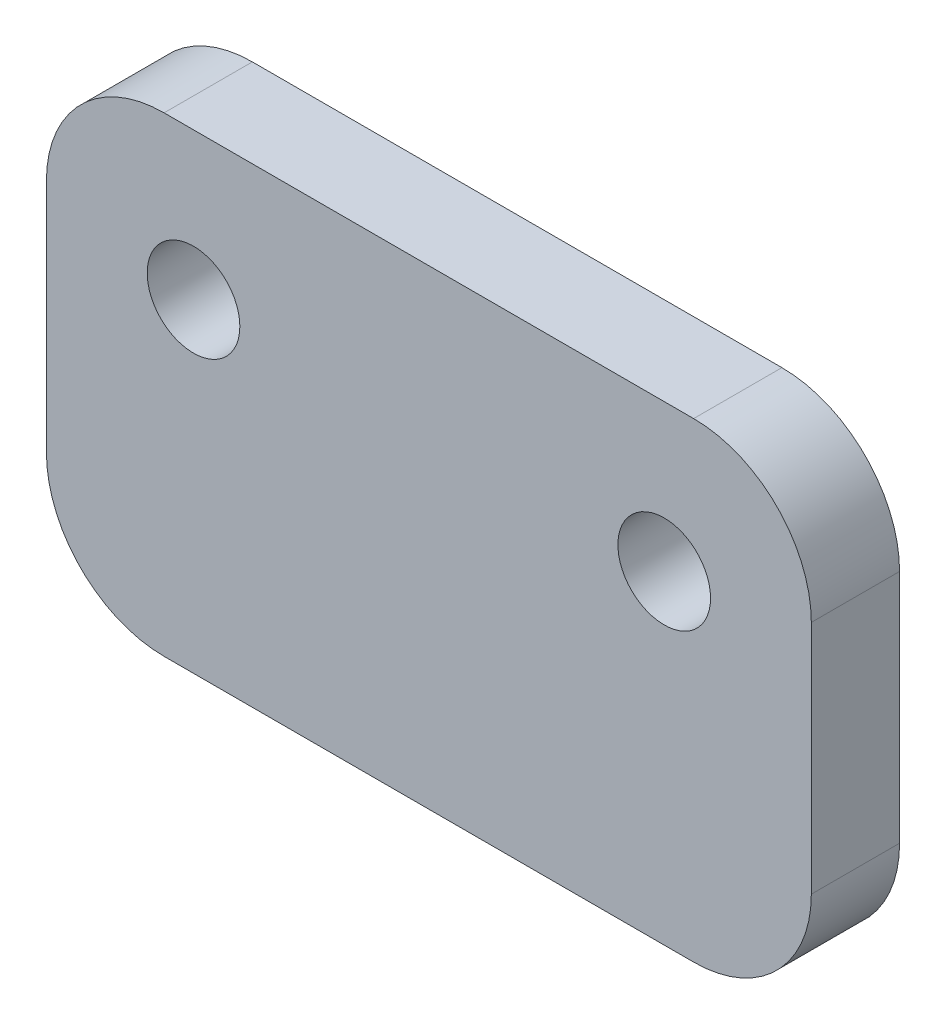
ISO-10303-21;
HEADER;
FILE_DESCRIPTION(('STEP AP214'),'2;1');
FILE_NAME('part.step','',(''),(''),'','','');
FILE_SCHEMA(('AUTOMOTIVE_DESIGN { 1 0 10303 214 1 1 1 1 }'));
ENDSEC;
DATA;
#1=APPLICATION_CONTEXT('core data for automotive mechanical design processes');
#2=APPLICATION_PROTOCOL_DEFINITION('international standard','automotive_design',2000,#1);
#3=PRODUCT_CONTEXT('',#1,'mechanical');
#4=PRODUCT('Part','Part','',(#3));
#5=PRODUCT_RELATED_PRODUCT_CATEGORY('part','',(#4));
#6=PRODUCT_DEFINITION_FORMATION('','',#4);
#7=PRODUCT_DEFINITION_CONTEXT('part definition',#1,'design');
#8=PRODUCT_DEFINITION('design','',#6,#7);
#9=PRODUCT_DEFINITION_SHAPE('','',#8);
#10=(LENGTH_UNIT() NAMED_UNIT(*) SI_UNIT(.MILLI.,.METRE.));
#11=(NAMED_UNIT(*) PLANE_ANGLE_UNIT() SI_UNIT($,.RADIAN.));
#12=(NAMED_UNIT(*) SI_UNIT($,.STERADIAN.) SOLID_ANGLE_UNIT());
#13=UNCERTAINTY_MEASURE_WITH_UNIT(LENGTH_MEASURE(1.E-05),#10,'distance_accuracy_value','');
#14=(GEOMETRIC_REPRESENTATION_CONTEXT(3) GLOBAL_UNCERTAINTY_ASSIGNED_CONTEXT((#13)) GLOBAL_UNIT_ASSIGNED_CONTEXT((#10,
#11,#12)) REPRESENTATION_CONTEXT('',''));
#15=CARTESIAN_POINT('',(0.,0.,0.));
#16=DIRECTION('',(0.,0.,1.));
#17=DIRECTION('',(1.,0.,0.));
#18=AXIS2_PLACEMENT_3D('',#15,#16,#17);
#19=CARTESIAN_POINT('',(-20.6375,-12.7,4.7625));
#20=DIRECTION('',(0.,0.,-1.));
#21=DIRECTION('',(-1.,0.,0.));
#22=AXIS2_PLACEMENT_3D('',#19,#20,#21);
#23=PLANE('',#22);
#24=CARTESIAN_POINT('',(-12.7,4.7625,4.7625));
#25=DIRECTION('',(0.,0.,1.));
#26=DIRECTION('',(1.,0.,0.));
#27=AXIS2_PLACEMENT_3D('',#24,#25,#26);
#28=CIRCLE('',#27,2.49999999999999);
#29=CARTESIAN_POINT('',(-10.2,4.7625,4.7625));
#30=VERTEX_POINT('',#29);
#31=EDGE_CURVE('E189',#30,#30,#28,.T.);
#32=ORIENTED_EDGE('',*,*,#31,.F.);
#33=EDGE_LOOP('',(#32));
#34=FACE_BOUND('',#33,.T.);
#35=DIRECTION('',(-1.,0.,0.));
#36=VECTOR('',#35,1.);
#37=CARTESIAN_POINT('',(20.6375,12.7,4.7625));
#38=LINE('',#37,#36);
#39=CARTESIAN_POINT('',(14.2875,12.7,4.7625));
#40=VERTEX_POINT('',#39);
#41=CARTESIAN_POINT('',(-14.2875,12.7,4.7625));
#42=VERTEX_POINT('',#41);
#43=EDGE_CURVE('E140',#40,#42,#38,.T.);
#44=ORIENTED_EDGE('',*,*,#43,.T.);
#45=CARTESIAN_POINT('',(-14.2875,6.35,4.7625));
#46=DIRECTION('',(0.,0.,-1.));
#47=DIRECTION('',(-1.,0.,0.));
#48=AXIS2_PLACEMENT_3D('',#45,#46,#47);
#49=CIRCLE('',#48,6.35);
#50=CARTESIAN_POINT('',(-20.6375,6.35,4.7625));
#51=VERTEX_POINT('',#50);
#52=EDGE_CURVE('E159',#42,#51,#49,.F.);
#53=ORIENTED_EDGE('',*,*,#52,.T.);
#54=DIRECTION('',(0.,-1.,0.));
#55=VECTOR('',#54,1.);
#56=CARTESIAN_POINT('',(-20.6375,12.7,4.7625));
#57=LINE('',#56,#55);
#58=CARTESIAN_POINT('',(-20.6375,-6.35,4.7625));
#59=VERTEX_POINT('',#58);
#60=EDGE_CURVE('E124',#51,#59,#57,.T.);
#61=ORIENTED_EDGE('',*,*,#60,.T.);
#62=CARTESIAN_POINT('',(-14.2875,-6.35,4.7625));
#63=DIRECTION('',(0.,0.,-1.));
#64=DIRECTION('',(-1.,0.,0.));
#65=AXIS2_PLACEMENT_3D('',#62,#63,#64);
#66=CIRCLE('',#65,6.35);
#67=CARTESIAN_POINT('',(-14.2875,-12.7,4.7625));
#68=VERTEX_POINT('',#67);
#69=EDGE_CURVE('E154',#59,#68,#66,.F.);
#70=ORIENTED_EDGE('',*,*,#69,.T.);
#71=DIRECTION('',(1.,0.,0.));
#72=VECTOR('',#71,1.);
#73=CARTESIAN_POINT('',(20.6375,-12.7,4.7625));
#74=LINE('',#73,#72);
#75=CARTESIAN_POINT('',(14.2875,-12.7,4.7625));
#76=VERTEX_POINT('',#75);
#77=EDGE_CURVE('E170',#68,#76,#74,.T.);
#78=ORIENTED_EDGE('',*,*,#77,.T.);
#79=CARTESIAN_POINT('',(14.2875,-6.35,4.7625));
#80=DIRECTION('',(0.,0.,-1.));
#81=DIRECTION('',(-1.,0.,0.));
#82=AXIS2_PLACEMENT_3D('',#79,#80,#81);
#83=CIRCLE('',#82,6.35);
#84=CARTESIAN_POINT('',(20.6375,-6.35,4.7625));
#85=VERTEX_POINT('',#84);
#86=EDGE_CURVE('E60',#76,#85,#83,.F.);
#87=ORIENTED_EDGE('',*,*,#86,.T.);
#88=DIRECTION('',(0.,1.,0.));
#89=VECTOR('',#88,1.);
#90=CARTESIAN_POINT('',(20.6375,12.7,4.7625));
#91=LINE('',#90,#89);
#92=CARTESIAN_POINT('',(20.6375,6.35,4.7625));
#93=VERTEX_POINT('',#92);
#94=EDGE_CURVE('E178',#85,#93,#91,.T.);
#95=ORIENTED_EDGE('',*,*,#94,.T.);
#96=CARTESIAN_POINT('',(14.2875,6.35,4.7625));
#97=DIRECTION('',(0.,0.,-1.));
#98=DIRECTION('',(-1.,0.,0.));
#99=AXIS2_PLACEMENT_3D('',#96,#97,#98);
#100=CIRCLE('',#99,6.35);
#101=EDGE_CURVE('E157',#93,#40,#100,.F.);
#102=ORIENTED_EDGE('',*,*,#101,.T.);
#103=EDGE_LOOP('',(#44,#53,#61,#70,#78,#87,#95,#102));
#104=FACE_BOUND('',#103,.T.);
#105=CARTESIAN_POINT('',(12.7,4.7625,4.7625));
#106=DIRECTION('',(0.,0.,1.));
#107=DIRECTION('',(1.,0.,0.));
#108=AXIS2_PLACEMENT_3D('',#105,#106,#107);
#109=CIRCLE('',#108,2.49999999999999);
#110=CARTESIAN_POINT('',(15.2,4.7625,4.7625));
#111=VERTEX_POINT('',#110);
#112=EDGE_CURVE('E137',#111,#111,#109,.T.);
#113=ORIENTED_EDGE('',*,*,#112,.F.);
#114=EDGE_LOOP('',(#113));
#115=FACE_BOUND('',#114,.T.);
#116=ADVANCED_FACE('F38',(#34,#104,#115),#23,.F.);
#117=CARTESIAN_POINT('',(-20.6375,12.7,4.7625));
#118=DIRECTION('',(1.,0.,0.));
#119=DIRECTION('',(0.,1.,0.));
#120=AXIS2_PLACEMENT_3D('',#117,#118,#119);
#121=PLANE('',#120);
#122=ORIENTED_EDGE('',*,*,#60,.F.);
#123=DIRECTION('',(0.,0.,-1.));
#124=VECTOR('',#123,1.);
#125=CARTESIAN_POINT('',(-20.6375,6.35,4.7625));
#126=LINE('',#125,#124);
#127=CARTESIAN_POINT('',(-20.6375,6.35,0.));
#128=VERTEX_POINT('',#127);
#129=EDGE_CURVE('E108',#51,#128,#126,.T.);
#130=ORIENTED_EDGE('',*,*,#129,.T.);
#131=DIRECTION('',(0.,-1.,0.));
#132=VECTOR('',#131,1.);
#133=CARTESIAN_POINT('',(-20.6375,12.7,0.));
#134=LINE('',#133,#132);
#135=CARTESIAN_POINT('',(-20.6375,-6.35,0.));
#136=VERTEX_POINT('',#135);
#137=EDGE_CURVE('E121',#128,#136,#134,.T.);
#138=ORIENTED_EDGE('',*,*,#137,.T.);
#139=DIRECTION('',(0.,0.,-1.));
#140=VECTOR('',#139,1.);
#141=CARTESIAN_POINT('',(-20.6375,-6.35,4.7625));
#142=LINE('',#141,#140);
#143=EDGE_CURVE('E126',#136,#59,#142,.F.);
#144=ORIENTED_EDGE('',*,*,#143,.T.);
#145=EDGE_LOOP('',(#122,#130,#138,#144));
#146=FACE_BOUND('',#145,.T.);
#147=ADVANCED_FACE('F120',(#146),#121,.F.);
#148=CARTESIAN_POINT('',(20.6375,-12.7,4.7625));
#149=DIRECTION('',(0.,1.,0.));
#150=DIRECTION('',(-1.,0.,0.));
#151=AXIS2_PLACEMENT_3D('',#148,#149,#150);
#152=PLANE('',#151);
#153=DIRECTION('',(1.,0.,0.));
#154=VECTOR('',#153,1.);
#155=CARTESIAN_POINT('',(20.6375,-12.7,0.));
#156=LINE('',#155,#154);
#157=CARTESIAN_POINT('',(-14.2875,-12.7,0.));
#158=VERTEX_POINT('',#157);
#159=CARTESIAN_POINT('',(14.2875,-12.7,0.));
#160=VERTEX_POINT('',#159);
#161=EDGE_CURVE('E130',#158,#160,#156,.T.);
#162=ORIENTED_EDGE('',*,*,#161,.T.);
#163=DIRECTION('',(0.,0.,-1.));
#164=VECTOR('',#163,1.);
#165=CARTESIAN_POINT('',(14.2875,-12.7,4.7625));
#166=LINE('',#165,#164);
#167=EDGE_CURVE('E11',#160,#76,#166,.F.);
#168=ORIENTED_EDGE('',*,*,#167,.T.);
#169=ORIENTED_EDGE('',*,*,#77,.F.);
#170=DIRECTION('',(0.,0.,-1.));
#171=VECTOR('',#170,1.);
#172=CARTESIAN_POINT('',(-14.2875,-12.7,4.7625));
#173=LINE('',#172,#171);
#174=EDGE_CURVE('E46',#68,#158,#173,.T.);
#175=ORIENTED_EDGE('',*,*,#174,.T.);
#176=EDGE_LOOP('',(#162,#168,#169,#175));
#177=FACE_BOUND('',#176,.T.);
#178=ADVANCED_FACE('F168',(#177),#152,.F.);
#179=CARTESIAN_POINT('',(20.6375,12.7,4.7625));
#180=DIRECTION('',(-1.,0.,0.));
#181=DIRECTION('',(0.,-1.,0.));
#182=AXIS2_PLACEMENT_3D('',#179,#180,#181);
#183=PLANE('',#182);
#184=DIRECTION('',(0.,1.,0.));
#185=VECTOR('',#184,1.);
#186=CARTESIAN_POINT('',(20.6375,12.7,0.));
#187=LINE('',#186,#185);
#188=CARTESIAN_POINT('',(20.6375,-6.35,0.));
#189=VERTEX_POINT('',#188);
#190=CARTESIAN_POINT('',(20.6375,6.35,0.));
#191=VERTEX_POINT('',#190);
#192=EDGE_CURVE('E134',#189,#191,#187,.T.);
#193=ORIENTED_EDGE('',*,*,#192,.T.);
#194=DIRECTION('',(0.,0.,-1.));
#195=VECTOR('',#194,1.);
#196=CARTESIAN_POINT('',(20.6375,6.35,4.7625));
#197=LINE('',#196,#195);
#198=EDGE_CURVE('E53',#191,#93,#197,.F.);
#199=ORIENTED_EDGE('',*,*,#198,.T.);
#200=ORIENTED_EDGE('',*,*,#94,.F.);
#201=DIRECTION('',(0.,0.,-1.));
#202=VECTOR('',#201,1.);
#203=CARTESIAN_POINT('',(20.6375,-6.35,4.7625));
#204=LINE('',#203,#202);
#205=EDGE_CURVE('E161',#85,#189,#204,.T.);
#206=ORIENTED_EDGE('',*,*,#205,.T.);
#207=EDGE_LOOP('',(#193,#199,#200,#206));
#208=FACE_BOUND('',#207,.T.);
#209=ADVANCED_FACE('F177',(#208),#183,.F.);
#210=CARTESIAN_POINT('',(20.6375,12.7,4.7625));
#211=DIRECTION('',(0.,-1.,0.));
#212=DIRECTION('',(0.,0.,-1.));
#213=AXIS2_PLACEMENT_3D('',#210,#211,#212);
#214=PLANE('',#213);
#215=DIRECTION('',(-1.,0.,0.));
#216=VECTOR('',#215,1.);
#217=CARTESIAN_POINT('',(20.6375,12.7,0.));
#218=LINE('',#217,#216);
#219=CARTESIAN_POINT('',(14.2875,12.7,0.));
#220=VERTEX_POINT('',#219);
#221=CARTESIAN_POINT('',(-14.2875,12.7,0.));
#222=VERTEX_POINT('',#221);
#223=EDGE_CURVE('E144',#220,#222,#218,.T.);
#224=ORIENTED_EDGE('',*,*,#223,.T.);
#225=DIRECTION('',(0.,0.,-1.));
#226=VECTOR('',#225,1.);
#227=CARTESIAN_POINT('',(-14.2875,12.7,4.7625));
#228=LINE('',#227,#226);
#229=EDGE_CURVE('E109',#222,#42,#228,.F.);
#230=ORIENTED_EDGE('',*,*,#229,.T.);
#231=ORIENTED_EDGE('',*,*,#43,.F.);
#232=DIRECTION('',(0.,0.,-1.));
#233=VECTOR('',#232,1.);
#234=CARTESIAN_POINT('',(14.2875,12.7,4.7625));
#235=LINE('',#234,#233);
#236=EDGE_CURVE('E114',#40,#220,#235,.T.);
#237=ORIENTED_EDGE('',*,*,#236,.T.);
#238=EDGE_LOOP('',(#224,#230,#231,#237));
#239=FACE_BOUND('',#238,.T.);
#240=ADVANCED_FACE('F209',(#239),#214,.F.);
#241=CARTESIAN_POINT('',(-20.6375,-12.7,0.));
#242=DIRECTION('',(0.,0.,-1.));
#243=DIRECTION('',(-1.,0.,0.));
#244=AXIS2_PLACEMENT_3D('',#241,#242,#243);
#245=PLANE('',#244);
#246=CARTESIAN_POINT('',(-12.7,4.7625,0.));
#247=DIRECTION('',(0.,0.,-1.));
#248=DIRECTION('',(-1.,0.,0.));
#249=AXIS2_PLACEMENT_3D('',#246,#247,#248);
#250=CIRCLE('',#249,2.49999999999999);
#251=CARTESIAN_POINT('',(-15.2,4.7625,0.));
#252=VERTEX_POINT('',#251);
#253=EDGE_CURVE('E186',#252,#252,#250,.T.);
#254=ORIENTED_EDGE('',*,*,#253,.F.);
#255=EDGE_LOOP('',(#254));
#256=FACE_BOUND('',#255,.T.);
#257=CARTESIAN_POINT('',(12.7,4.7625,0.));
#258=DIRECTION('',(0.,0.,-1.));
#259=DIRECTION('',(-1.,0.,0.));
#260=AXIS2_PLACEMENT_3D('',#257,#258,#259);
#261=CIRCLE('',#260,2.49999999999999);
#262=CARTESIAN_POINT('',(10.2,4.7625,0.));
#263=VERTEX_POINT('',#262);
#264=EDGE_CURVE('E131',#263,#263,#261,.T.);
#265=ORIENTED_EDGE('',*,*,#264,.F.);
#266=EDGE_LOOP('',(#265));
#267=FACE_BOUND('',#266,.T.);
#268=ORIENTED_EDGE('',*,*,#137,.F.);
#269=CARTESIAN_POINT('',(-14.2875,6.35,0.));
#270=DIRECTION('',(0.,0.,-1.));
#271=DIRECTION('',(-1.,0.,0.));
#272=AXIS2_PLACEMENT_3D('',#269,#270,#271);
#273=CIRCLE('',#272,6.35);
#274=EDGE_CURVE('E104',#128,#222,#273,.T.);
#275=ORIENTED_EDGE('',*,*,#274,.T.);
#276=ORIENTED_EDGE('',*,*,#223,.F.);
#277=CARTESIAN_POINT('',(14.2875,6.35,0.));
#278=DIRECTION('',(0.,0.,-1.));
#279=DIRECTION('',(-1.,0.,0.));
#280=AXIS2_PLACEMENT_3D('',#277,#278,#279);
#281=CIRCLE('',#280,6.35);
#282=EDGE_CURVE('E115',#220,#191,#281,.T.);
#283=ORIENTED_EDGE('',*,*,#282,.T.);
#284=ORIENTED_EDGE('',*,*,#192,.F.);
#285=CARTESIAN_POINT('',(14.2875,-6.35,0.));
#286=DIRECTION('',(0.,0.,-1.));
#287=DIRECTION('',(-1.,0.,0.));
#288=AXIS2_PLACEMENT_3D('',#285,#286,#287);
#289=CIRCLE('',#288,6.35);
#290=EDGE_CURVE('E148',#189,#160,#289,.T.);
#291=ORIENTED_EDGE('',*,*,#290,.T.);
#292=ORIENTED_EDGE('',*,*,#161,.F.);
#293=CARTESIAN_POINT('',(-14.2875,-6.35,0.));
#294=DIRECTION('',(0.,0.,-1.));
#295=DIRECTION('',(-1.,0.,0.));
#296=AXIS2_PLACEMENT_3D('',#293,#294,#295);
#297=CIRCLE('',#296,6.35);
#298=EDGE_CURVE('E125',#158,#136,#297,.T.);
#299=ORIENTED_EDGE('',*,*,#298,.T.);
#300=EDGE_LOOP('',(#268,#275,#276,#283,#284,#291,#292,#299));
#301=FACE_BOUND('',#300,.T.);
#302=ADVANCED_FACE('F128',(#256,#267,#301),#245,.T.);
#303=CARTESIAN_POINT('',(-14.2875,6.35,4.7625));
#304=DIRECTION('',(0.,0.,-1.));
#305=DIRECTION('',(-1.,0.,0.));
#306=AXIS2_PLACEMENT_3D('',#303,#304,#305);
#307=CYLINDRICAL_SURFACE('',#306,6.35);
#308=ORIENTED_EDGE('',*,*,#52,.F.);
#309=ORIENTED_EDGE('',*,*,#229,.F.);
#310=ORIENTED_EDGE('',*,*,#274,.F.);
#311=ORIENTED_EDGE('',*,*,#129,.F.);
#312=EDGE_LOOP('',(#308,#309,#310,#311));
#313=FACE_BOUND('',#312,.T.);
#314=ADVANCED_FACE('F107',(#313),#307,.T.);
#315=CARTESIAN_POINT('',(14.2875,6.35,4.7625));
#316=DIRECTION('',(0.,0.,-1.));
#317=DIRECTION('',(-1.,0.,0.));
#318=AXIS2_PLACEMENT_3D('',#315,#316,#317);
#319=CYLINDRICAL_SURFACE('',#318,6.35);
#320=ORIENTED_EDGE('',*,*,#101,.F.);
#321=ORIENTED_EDGE('',*,*,#198,.F.);
#322=ORIENTED_EDGE('',*,*,#282,.F.);
#323=ORIENTED_EDGE('',*,*,#236,.F.);
#324=EDGE_LOOP('',(#320,#321,#322,#323));
#325=FACE_BOUND('',#324,.T.);
#326=ADVANCED_FACE('F216',(#325),#319,.T.);
#327=CARTESIAN_POINT('',(14.2875,-6.35,4.7625));
#328=DIRECTION('',(0.,0.,-1.));
#329=DIRECTION('',(-1.,0.,0.));
#330=AXIS2_PLACEMENT_3D('',#327,#328,#329);
#331=CYLINDRICAL_SURFACE('',#330,6.35);
#332=ORIENTED_EDGE('',*,*,#86,.F.);
#333=ORIENTED_EDGE('',*,*,#167,.F.);
#334=ORIENTED_EDGE('',*,*,#290,.F.);
#335=ORIENTED_EDGE('',*,*,#205,.F.);
#336=EDGE_LOOP('',(#332,#333,#334,#335));
#337=FACE_BOUND('',#336,.T.);
#338=ADVANCED_FACE('F176',(#337),#331,.T.);
#339=CARTESIAN_POINT('',(-14.2875,-6.35,4.7625));
#340=DIRECTION('',(0.,0.,-1.));
#341=DIRECTION('',(-1.,0.,0.));
#342=AXIS2_PLACEMENT_3D('',#339,#340,#341);
#343=CYLINDRICAL_SURFACE('',#342,6.35);
#344=ORIENTED_EDGE('',*,*,#69,.F.);
#345=ORIENTED_EDGE('',*,*,#143,.F.);
#346=ORIENTED_EDGE('',*,*,#298,.F.);
#347=ORIENTED_EDGE('',*,*,#174,.F.);
#348=EDGE_LOOP('',(#344,#345,#346,#347));
#349=FACE_BOUND('',#348,.T.);
#350=ADVANCED_FACE('F40',(#349),#343,.T.);
#351=CARTESIAN_POINT('',(12.7,4.7625,4.7625));
#352=DIRECTION('',(0.,0.,1.));
#353=DIRECTION('',(1.,0.,0.));
#354=AXIS2_PLACEMENT_3D('',#351,#352,#353);
#355=CYLINDRICAL_SURFACE('',#354,2.49999999999999);
#356=ORIENTED_EDGE('',*,*,#112,.T.);
#357=EDGE_LOOP('',(#356));
#358=FACE_BOUND('',#357,.T.);
#359=ORIENTED_EDGE('',*,*,#264,.T.);
#360=EDGE_LOOP('',(#359));
#361=FACE_BOUND('',#360,.T.);
#362=ADVANCED_FACE('F202',(#358,#361),#355,.F.);
#363=CARTESIAN_POINT('',(-12.7,4.7625,4.7625));
#364=DIRECTION('',(0.,0.,1.));
#365=DIRECTION('',(1.,0.,0.));
#366=AXIS2_PLACEMENT_3D('',#363,#364,#365);
#367=CYLINDRICAL_SURFACE('',#366,2.49999999999999);
#368=ORIENTED_EDGE('',*,*,#31,.T.);
#369=EDGE_LOOP('',(#368));
#370=FACE_BOUND('',#369,.T.);
#371=ORIENTED_EDGE('',*,*,#253,.T.);
#372=EDGE_LOOP('',(#371));
#373=FACE_BOUND('',#372,.T.);
#374=ADVANCED_FACE('F193',(#370,#373),#367,.F.);
#375=CLOSED_SHELL('',(#116,#147,#178,#209,#240,#302,#314,#326,#338,#350,#362,#374));
#376=MANIFOLD_SOLID_BREP('B2',#375);
#377=ADVANCED_BREP_SHAPE_REPRESENTATION('',(#18,#376),#14);
#378=SHAPE_DEFINITION_REPRESENTATION(#9,#377);
ENDSEC;
END-ISO-10303-21;
